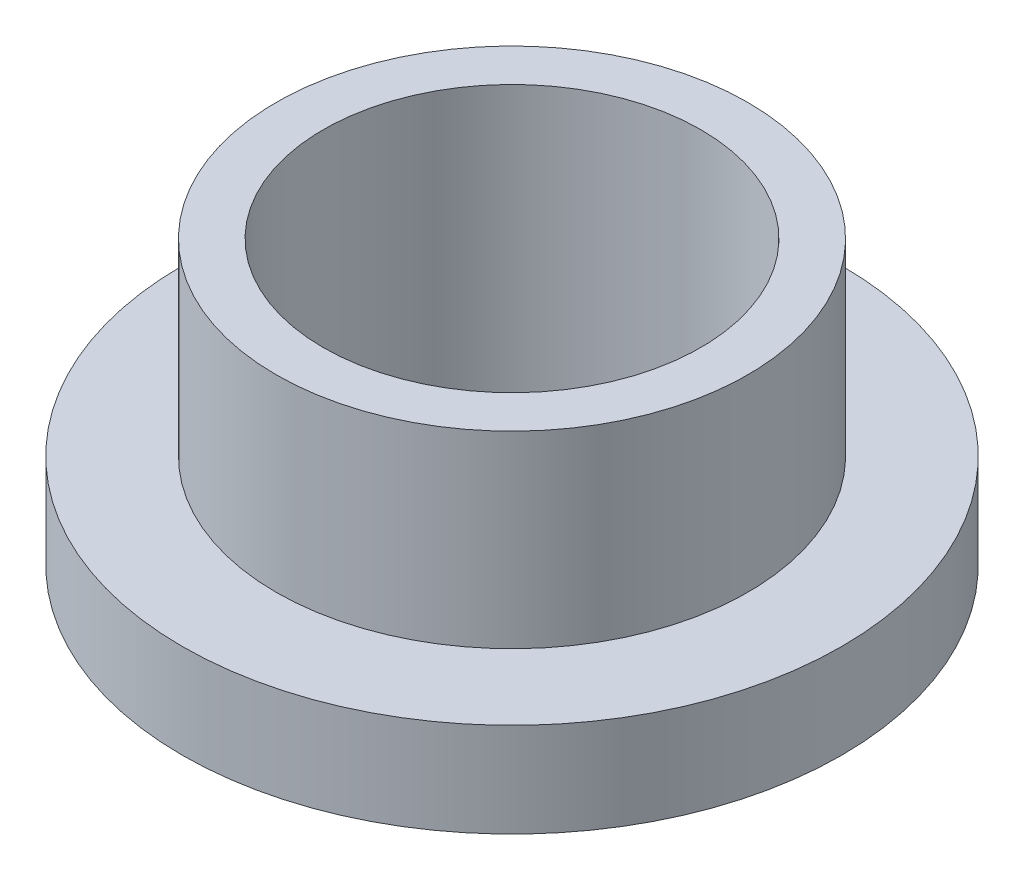
ISO-10303-21;
HEADER;
FILE_DESCRIPTION(('STEP AP214'),'2;1');
FILE_NAME('part.step','',(''),(''),'','','');
FILE_SCHEMA(('AUTOMOTIVE_DESIGN { 1 0 10303 214 1 1 1 1 }'));
ENDSEC;
DATA;
#1=APPLICATION_CONTEXT('core data for automotive mechanical design processes');
#2=APPLICATION_PROTOCOL_DEFINITION('international standard','automotive_design',2000,#1);
#3=PRODUCT_CONTEXT('',#1,'mechanical');
#4=PRODUCT('Part','Part','',(#3));
#5=PRODUCT_RELATED_PRODUCT_CATEGORY('part','',(#4));
#6=PRODUCT_DEFINITION_FORMATION('','',#4);
#7=PRODUCT_DEFINITION_CONTEXT('part definition',#1,'design');
#8=PRODUCT_DEFINITION('design','',#6,#7);
#9=PRODUCT_DEFINITION_SHAPE('','',#8);
#10=(LENGTH_UNIT() NAMED_UNIT(*) SI_UNIT(.MILLI.,.METRE.));
#11=(NAMED_UNIT(*) PLANE_ANGLE_UNIT() SI_UNIT($,.RADIAN.));
#12=(NAMED_UNIT(*) SI_UNIT($,.STERADIAN.) SOLID_ANGLE_UNIT());
#13=UNCERTAINTY_MEASURE_WITH_UNIT(LENGTH_MEASURE(1.E-05),#10,'distance_accuracy_value','');
#14=(GEOMETRIC_REPRESENTATION_CONTEXT(3) GLOBAL_UNCERTAINTY_ASSIGNED_CONTEXT((#13)) GLOBAL_UNIT_ASSIGNED_CONTEXT((#10,
#11,#12)) REPRESENTATION_CONTEXT('',''));
#15=CARTESIAN_POINT('',(0.,0.,0.));
#16=DIRECTION('',(0.,0.,1.));
#17=DIRECTION('',(1.,0.,0.));
#18=AXIS2_PLACEMENT_3D('',#15,#16,#17);
#19=CARTESIAN_POINT('',(0.,9.525,0.));
#20=DIRECTION('',(0.,1.,0.));
#21=DIRECTION('',(0.,0.,1.));
#22=AXIS2_PLACEMENT_3D('',#19,#20,#21);
#23=PLANE('',#22);
#24=CARTESIAN_POINT('',(0.,9.525,0.));
#25=DIRECTION('',(0.,1.,0.));
#26=DIRECTION('',(0.,0.,1.));
#27=AXIS2_PLACEMENT_3D('',#24,#25,#26);
#28=CIRCLE('',#27,7.9502);
#29=CARTESIAN_POINT('',(0.,9.525,7.9502));
#30=VERTEX_POINT('',#29);
#31=EDGE_CURVE('E10',#30,#30,#28,.T.);
#32=ORIENTED_EDGE('',*,*,#31,.T.);
#33=EDGE_LOOP('',(#32));
#34=FACE_BOUND('',#33,.T.);
#35=CARTESIAN_POINT('',(0.,9.525,0.));
#36=DIRECTION('',(0.,1.,0.));
#37=DIRECTION('',(0.,0.,1.));
#38=AXIS2_PLACEMENT_3D('',#35,#36,#37);
#39=CIRCLE('',#38,6.3627);
#40=CARTESIAN_POINT('',(0.,9.525,6.3627));
#41=VERTEX_POINT('',#40);
#42=EDGE_CURVE('E37',#41,#41,#39,.T.);
#43=ORIENTED_EDGE('',*,*,#42,.F.);
#44=EDGE_LOOP('',(#43));
#45=FACE_BOUND('',#44,.T.);
#46=ADVANCED_FACE('F30',(#34,#45),#23,.T.);
#47=CARTESIAN_POINT('',(0.,0.,0.));
#48=DIRECTION('',(0.,1.,0.));
#49=DIRECTION('',(0.,0.,1.));
#50=AXIS2_PLACEMENT_3D('',#47,#48,#49);
#51=PLANE('',#50);
#52=CARTESIAN_POINT('',(0.,0.,0.));
#53=DIRECTION('',(0.,1.,0.));
#54=DIRECTION('',(0.,0.,1.));
#55=AXIS2_PLACEMENT_3D('',#52,#53,#54);
#56=CIRCLE('',#55,6.3627);
#57=CARTESIAN_POINT('',(0.,0.,6.3627));
#58=VERTEX_POINT('',#57);
#59=EDGE_CURVE('E41',#58,#58,#56,.T.);
#60=ORIENTED_EDGE('',*,*,#59,.T.);
#61=EDGE_LOOP('',(#60));
#62=FACE_BOUND('',#61,.T.);
#63=CARTESIAN_POINT('',(0.,0.,0.));
#64=DIRECTION('',(0.,1.,0.));
#65=DIRECTION('',(0.,0.,1.));
#66=AXIS2_PLACEMENT_3D('',#63,#64,#65);
#67=CIRCLE('',#66,11.1125);
#68=CARTESIAN_POINT('',(0.,0.,11.1125));
#69=VERTEX_POINT('',#68);
#70=EDGE_CURVE('E48',#69,#69,#67,.T.);
#71=ORIENTED_EDGE('',*,*,#70,.F.);
#72=EDGE_LOOP('',(#71));
#73=FACE_BOUND('',#72,.T.);
#74=ADVANCED_FACE('F73',(#62,#73),#51,.F.);
#75=CARTESIAN_POINT('',(0.,9.525,0.));
#76=DIRECTION('',(0.,-1.,0.));
#77=DIRECTION('',(0.,0.,-1.));
#78=AXIS2_PLACEMENT_3D('',#75,#76,#77);
#79=CYLINDRICAL_SURFACE('',#78,7.9502);
#80=CARTESIAN_POINT('',(0.,3.175,0.));
#81=DIRECTION('',(0.,1.,0.));
#82=DIRECTION('',(0.,0.,1.));
#83=AXIS2_PLACEMENT_3D('',#80,#81,#82);
#84=CIRCLE('',#83,7.9502);
#85=CARTESIAN_POINT('',(0.,3.175,7.9502));
#86=VERTEX_POINT('',#85);
#87=EDGE_CURVE('E51',#86,#86,#84,.T.);
#88=ORIENTED_EDGE('',*,*,#87,.T.);
#89=EDGE_LOOP('',(#88));
#90=FACE_BOUND('',#89,.T.);
#91=ORIENTED_EDGE('',*,*,#31,.F.);
#92=EDGE_LOOP('',(#91));
#93=FACE_BOUND('',#92,.T.);
#94=ADVANCED_FACE('F32',(#90,#93),#79,.T.);
#95=CARTESIAN_POINT('',(0.,9.525,0.));
#96=DIRECTION('',(0.,-1.,0.));
#97=DIRECTION('',(0.,0.,-1.));
#98=AXIS2_PLACEMENT_3D('',#95,#96,#97);
#99=CYLINDRICAL_SURFACE('',#98,6.3627);
#100=ORIENTED_EDGE('',*,*,#42,.T.);
#101=EDGE_LOOP('',(#100));
#102=FACE_BOUND('',#101,.T.);
#103=ORIENTED_EDGE('',*,*,#59,.F.);
#104=EDGE_LOOP('',(#103));
#105=FACE_BOUND('',#104,.T.);
#106=ADVANCED_FACE('F62',(#102,#105),#99,.F.);
#107=CARTESIAN_POINT('',(0.,3.175,0.));
#108=DIRECTION('',(0.,1.,0.));
#109=DIRECTION('',(0.,0.,1.));
#110=AXIS2_PLACEMENT_3D('',#107,#108,#109);
#111=PLANE('',#110);
#112=CARTESIAN_POINT('',(0.,3.175,0.));
#113=DIRECTION('',(0.,1.,0.));
#114=DIRECTION('',(0.,0.,1.));
#115=AXIS2_PLACEMENT_3D('',#112,#113,#114);
#116=CIRCLE('',#115,11.1125);
#117=CARTESIAN_POINT('',(0.,3.175,11.1125));
#118=VERTEX_POINT('',#117);
#119=EDGE_CURVE('E46',#118,#118,#116,.T.);
#120=ORIENTED_EDGE('',*,*,#119,.T.);
#121=EDGE_LOOP('',(#120));
#122=FACE_BOUND('',#121,.T.);
#123=ORIENTED_EDGE('',*,*,#87,.F.);
#124=EDGE_LOOP('',(#123));
#125=FACE_BOUND('',#124,.T.);
#126=ADVANCED_FACE('F59',(#122,#125),#111,.T.);
#127=CARTESIAN_POINT('',(0.,3.175,0.));
#128=DIRECTION('',(0.,-1.,0.));
#129=DIRECTION('',(0.,0.,-1.));
#130=AXIS2_PLACEMENT_3D('',#127,#128,#129);
#131=CYLINDRICAL_SURFACE('',#130,11.1125);
#132=ORIENTED_EDGE('',*,*,#119,.F.);
#133=EDGE_LOOP('',(#132));
#134=FACE_BOUND('',#133,.T.);
#135=ORIENTED_EDGE('',*,*,#70,.T.);
#136=EDGE_LOOP('',(#135));
#137=FACE_BOUND('',#136,.T.);
#138=ADVANCED_FACE('F61',(#134,#137),#131,.T.);
#139=CLOSED_SHELL('',(#46,#74,#94,#106,#126,#138));
#140=MANIFOLD_SOLID_BREP('B2',#139);
#141=ADVANCED_BREP_SHAPE_REPRESENTATION('',(#18,#140),#14);
#142=SHAPE_DEFINITION_REPRESENTATION(#9,#141);
ENDSEC;
END-ISO-10303-21;
